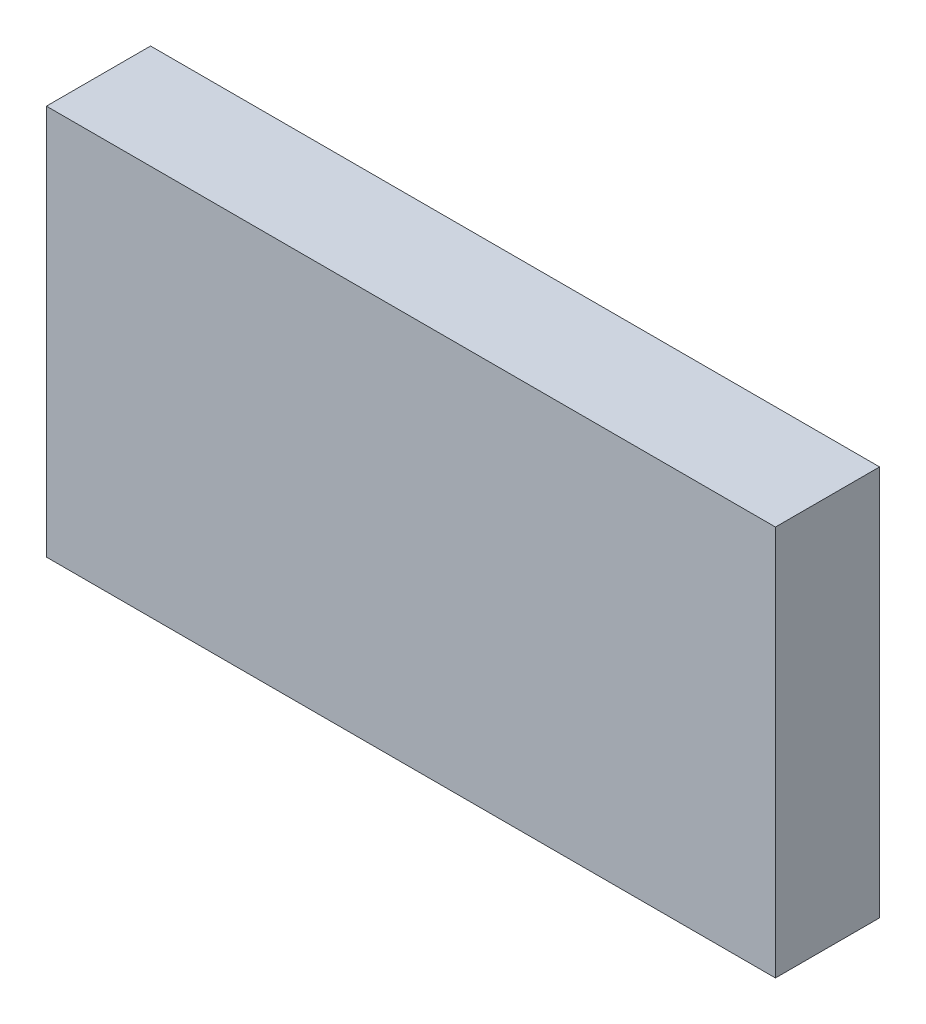
ISO-10303-21;
HEADER;
FILE_DESCRIPTION(('STEP AP214'),'2;1');
FILE_NAME('part.step','',(''),(''),'','','');
FILE_SCHEMA(('AUTOMOTIVE_DESIGN { 1 0 10303 214 1 1 1 1 }'));
ENDSEC;
DATA;
#1=APPLICATION_CONTEXT('core data for automotive mechanical design processes');
#2=APPLICATION_PROTOCOL_DEFINITION('international standard','automotive_design',2000,#1);
#3=PRODUCT_CONTEXT('',#1,'mechanical');
#4=PRODUCT('Part','Part','',(#3));
#5=PRODUCT_RELATED_PRODUCT_CATEGORY('part','',(#4));
#6=PRODUCT_DEFINITION_FORMATION('','',#4);
#7=PRODUCT_DEFINITION_CONTEXT('part definition',#1,'design');
#8=PRODUCT_DEFINITION('design','',#6,#7);
#9=PRODUCT_DEFINITION_SHAPE('','',#8);
#10=(LENGTH_UNIT() NAMED_UNIT(*) SI_UNIT(.MILLI.,.METRE.));
#11=(NAMED_UNIT(*) PLANE_ANGLE_UNIT() SI_UNIT($,.RADIAN.));
#12=(NAMED_UNIT(*) SI_UNIT($,.STERADIAN.) SOLID_ANGLE_UNIT());
#13=UNCERTAINTY_MEASURE_WITH_UNIT(LENGTH_MEASURE(1.E-05),#10,'distance_accuracy_value','');
#14=(GEOMETRIC_REPRESENTATION_CONTEXT(3) GLOBAL_UNCERTAINTY_ASSIGNED_CONTEXT((#13)) GLOBAL_UNIT_ASSIGNED_CONTEXT((#10,
#11,#12)) REPRESENTATION_CONTEXT('',''));
#15=CARTESIAN_POINT('',(0.,0.,0.));
#16=DIRECTION('',(0.,0.,1.));
#17=DIRECTION('',(1.,0.,0.));
#18=AXIS2_PLACEMENT_3D('',#15,#16,#17);
#19=CARTESIAN_POINT('',(-1.29732901160097,-0.755187491496895,0.0826433070866142));
#20=DIRECTION('',(0.,0.,-1.));
#21=DIRECTION('',(0.,1.,0.));
#22=AXIS2_PLACEMENT_3D('',#19,#20,#21);
#23=PLANE('',#22);
#24=DIRECTION('',(0.,1.,0.));
#25=VECTOR('',#24,1.);
#26=CARTESIAN_POINT('',(-1.29380145254586,-0.755187491496895,0.0826433070866142));
#27=LINE('',#26,#25);
#28=CARTESIAN_POINT('',(-1.29380145254586,-0.715502452126816,0.0826433070866142));
#29=VERTEX_POINT('',#28);
#30=CARTESIAN_POINT('',(-1.29380145254586,-0.753297727717367,0.0826433070866142));
#31=VERTEX_POINT('',#30);
#32=EDGE_CURVE('E71',#29,#31,#27,.F.);
#33=ORIENTED_EDGE('',*,*,#32,.T.);
#34=DIRECTION('',(1.,0.,0.));
#35=VECTOR('',#34,1.);
#36=CARTESIAN_POINT('',(-1.21972271238837,-0.753297727717367,0.0826433070866142));
#37=LINE('',#36,#35);
#38=CARTESIAN_POINT('',(-1.22325027144349,-0.753297727717367,0.0826433070866142));
#39=VERTEX_POINT('',#38);
#40=EDGE_CURVE('E54',#39,#31,#37,.F.);
#41=ORIENTED_EDGE('',*,*,#40,.F.);
#42=DIRECTION('',(0.,1.,0.));
#43=VECTOR('',#42,1.);
#44=CARTESIAN_POINT('',(-1.22325027144349,-0.755187491496895,0.0826433070866142));
#45=LINE('',#44,#43);
#46=CARTESIAN_POINT('',(-1.22325027144349,-0.715502452126816,0.0826433070866142));
#47=VERTEX_POINT('',#46);
#48=EDGE_CURVE('E20',#47,#39,#45,.F.);
#49=ORIENTED_EDGE('',*,*,#48,.F.);
#50=DIRECTION('',(1.,0.,0.));
#51=VECTOR('',#50,1.);
#52=CARTESIAN_POINT('',(-1.21972271238837,-0.715502452126816,0.0826433070866142));
#53=LINE('',#52,#51);
#54=EDGE_CURVE('E81',#29,#47,#53,.T.);
#55=ORIENTED_EDGE('',*,*,#54,.F.);
#56=EDGE_LOOP('',(#33,#41,#49,#55));
#57=FACE_BOUND('',#56,.T.);
#58=ADVANCED_FACE('F17',(#57),#23,.F.);
#59=CARTESIAN_POINT('',(-1.22325027144349,-0.755187491496895,0.0720606299212598));
#60=DIRECTION('',(-1.,0.,0.));
#61=DIRECTION('',(0.,0.,1.));
#62=AXIS2_PLACEMENT_3D('',#59,#60,#61);
#63=PLANE('',#62);
#64=DIRECTION('',(0.,0.,-1.));
#65=VECTOR('',#64,1.);
#66=CARTESIAN_POINT('',(-1.22325027144349,-0.715502452126816,0.0831472440944882));
#67=LINE('',#66,#65);
#68=CARTESIAN_POINT('',(-1.22325027144349,-0.715502452126816,0.0725645669291339));
#69=VERTEX_POINT('',#68);
#70=EDGE_CURVE('E64',#47,#69,#67,.T.);
#71=ORIENTED_EDGE('',*,*,#70,.F.);
#72=ORIENTED_EDGE('',*,*,#48,.T.);
#73=DIRECTION('',(0.,0.,1.));
#74=VECTOR('',#73,1.);
#75=CARTESIAN_POINT('',(-1.22325027144349,-0.753297727717367,0.0720606299212598));
#76=LINE('',#75,#74);
#77=CARTESIAN_POINT('',(-1.22325027144349,-0.753297727717367,0.0725645669291339));
#78=VERTEX_POINT('',#77);
#79=EDGE_CURVE('E62',#78,#39,#76,.T.);
#80=ORIENTED_EDGE('',*,*,#79,.F.);
#81=DIRECTION('',(0.,-1.,0.));
#82=VECTOR('',#81,1.);
#83=CARTESIAN_POINT('',(-1.22325027144349,-0.755187491496895,0.0725645669291339));
#84=LINE('',#83,#82);
#85=EDGE_CURVE('E83',#69,#78,#84,.T.);
#86=ORIENTED_EDGE('',*,*,#85,.F.);
#87=EDGE_LOOP('',(#71,#72,#80,#86));
#88=FACE_BOUND('',#87,.T.);
#89=ADVANCED_FACE('F60',(#88),#63,.F.);
#90=CARTESIAN_POINT('',(-1.21972271238837,-0.753297727717367,0.0720606299212598));
#91=DIRECTION('',(0.,1.,0.));
#92=DIRECTION('',(0.,0.,1.));
#93=AXIS2_PLACEMENT_3D('',#90,#91,#92);
#94=PLANE('',#93);
#95=DIRECTION('',(0.,0.,1.));
#96=VECTOR('',#95,1.);
#97=CARTESIAN_POINT('',(-1.29380145254586,-0.753297727717367,0.0720606299212598));
#98=LINE('',#97,#96);
#99=CARTESIAN_POINT('',(-1.29380145254586,-0.753297727717367,0.0725645669291339));
#100=VERTEX_POINT('',#99);
#101=EDGE_CURVE('E73',#31,#100,#98,.F.);
#102=ORIENTED_EDGE('',*,*,#101,.T.);
#103=DIRECTION('',(1.,0.,0.));
#104=VECTOR('',#103,1.);
#105=CARTESIAN_POINT('',(-1.21972271238837,-0.753297727717367,0.0725645669291339));
#106=LINE('',#105,#104);
#107=EDGE_CURVE('E69',#78,#100,#106,.F.);
#108=ORIENTED_EDGE('',*,*,#107,.F.);
#109=ORIENTED_EDGE('',*,*,#79,.T.);
#110=ORIENTED_EDGE('',*,*,#40,.T.);
#111=EDGE_LOOP('',(#102,#108,#109,#110));
#112=FACE_BOUND('',#111,.T.);
#113=ADVANCED_FACE('F68',(#112),#94,.F.);
#114=CARTESIAN_POINT('',(-1.29380145254586,-0.755187491496895,0.0720606299212598));
#115=DIRECTION('',(-1.,0.,0.));
#116=DIRECTION('',(0.,0.,1.));
#117=AXIS2_PLACEMENT_3D('',#114,#115,#116);
#118=PLANE('',#117);
#119=ORIENTED_EDGE('',*,*,#32,.F.);
#120=DIRECTION('',(0.,0.,-1.));
#121=VECTOR('',#120,1.);
#122=CARTESIAN_POINT('',(-1.29380145254586,-0.715502452126816,0.0831472440944882));
#123=LINE('',#122,#121);
#124=CARTESIAN_POINT('',(-1.29380145254586,-0.715502452126816,0.0725645669291339));
#125=VERTEX_POINT('',#124);
#126=EDGE_CURVE('E78',#125,#29,#123,.F.);
#127=ORIENTED_EDGE('',*,*,#126,.F.);
#128=DIRECTION('',(0.,-1.,0.));
#129=VECTOR('',#128,1.);
#130=CARTESIAN_POINT('',(-1.29380145254586,-0.755187491496895,0.0725645669291339));
#131=LINE('',#130,#129);
#132=EDGE_CURVE('E26',#100,#125,#131,.F.);
#133=ORIENTED_EDGE('',*,*,#132,.F.);
#134=ORIENTED_EDGE('',*,*,#101,.F.);
#135=EDGE_LOOP('',(#119,#127,#133,#134));
#136=FACE_BOUND('',#135,.T.);
#137=ADVANCED_FACE('F88',(#136),#118,.T.);
#138=CARTESIAN_POINT('',(-1.21972271238837,-0.715502452126816,0.0831472440944882));
#139=DIRECTION('',(0.,-1.,0.));
#140=DIRECTION('',(0.,0.,-1.));
#141=AXIS2_PLACEMENT_3D('',#138,#139,#140);
#142=PLANE('',#141);
#143=ORIENTED_EDGE('',*,*,#126,.T.);
#144=ORIENTED_EDGE('',*,*,#54,.T.);
#145=ORIENTED_EDGE('',*,*,#70,.T.);
#146=DIRECTION('',(1.,0.,0.));
#147=VECTOR('',#146,1.);
#148=CARTESIAN_POINT('',(-1.21972271238837,-0.715502452126816,0.0725645669291339));
#149=LINE('',#148,#147);
#150=EDGE_CURVE('E11',#125,#69,#149,.T.);
#151=ORIENTED_EDGE('',*,*,#150,.F.);
#152=EDGE_LOOP('',(#143,#144,#145,#151));
#153=FACE_BOUND('',#152,.T.);
#154=ADVANCED_FACE('F91',(#153),#142,.F.);
#155=CARTESIAN_POINT('',(-1.21972271238837,-0.755187491496895,0.0725645669291339));
#156=DIRECTION('',(0.,0.,1.));
#157=DIRECTION('',(0.,-1.,0.));
#158=AXIS2_PLACEMENT_3D('',#155,#156,#157);
#159=PLANE('',#158);
#160=ORIENTED_EDGE('',*,*,#132,.T.);
#161=ORIENTED_EDGE('',*,*,#150,.T.);
#162=ORIENTED_EDGE('',*,*,#85,.T.);
#163=ORIENTED_EDGE('',*,*,#107,.T.);
#164=EDGE_LOOP('',(#160,#161,#162,#163));
#165=FACE_BOUND('',#164,.T.);
#166=ADVANCED_FACE('F86',(#165),#159,.F.);
#167=CLOSED_SHELL('',(#58,#89,#113,#137,#154,#166));
#168=MANIFOLD_SOLID_BREP('B1',#167);
#169=ADVANCED_BREP_SHAPE_REPRESENTATION('',(#18,#168),#14);
#170=SHAPE_DEFINITION_REPRESENTATION(#9,#169);
ENDSEC;
END-ISO-10303-21;
